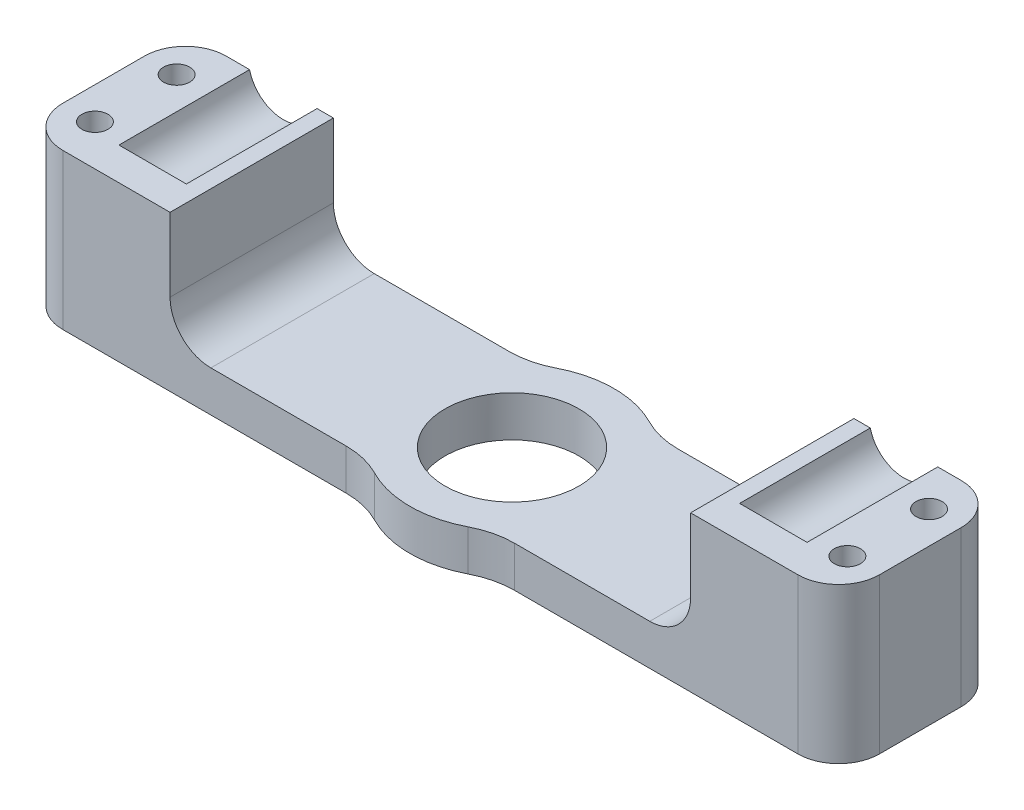
ISO-10303-21;
HEADER;
FILE_DESCRIPTION(('STEP AP214'),'2;1');
FILE_NAME('part.step','',(''),(''),'','','');
FILE_SCHEMA(('AUTOMOTIVE_DESIGN { 1 0 10303 214 1 1 1 1 }'));
ENDSEC;
DATA;
#1=APPLICATION_CONTEXT('core data for automotive mechanical design processes');
#2=APPLICATION_PROTOCOL_DEFINITION('international standard','automotive_design',2000,#1);
#3=PRODUCT_CONTEXT('',#1,'mechanical');
#4=PRODUCT('Part','Part','',(#3));
#5=PRODUCT_RELATED_PRODUCT_CATEGORY('part','',(#4));
#6=PRODUCT_DEFINITION_FORMATION('','',#4);
#7=PRODUCT_DEFINITION_CONTEXT('part definition',#1,'design');
#8=PRODUCT_DEFINITION('design','',#6,#7);
#9=PRODUCT_DEFINITION_SHAPE('','',#8);
#10=(LENGTH_UNIT() NAMED_UNIT(*) SI_UNIT(.MILLI.,.METRE.));
#11=(NAMED_UNIT(*) PLANE_ANGLE_UNIT() SI_UNIT($,.RADIAN.));
#12=(NAMED_UNIT(*) SI_UNIT($,.STERADIAN.) SOLID_ANGLE_UNIT());
#13=UNCERTAINTY_MEASURE_WITH_UNIT(LENGTH_MEASURE(1.E-05),#10,'distance_accuracy_value','');
#14=(GEOMETRIC_REPRESENTATION_CONTEXT(3) GLOBAL_UNCERTAINTY_ASSIGNED_CONTEXT((#13)) GLOBAL_UNIT_ASSIGNED_CONTEXT((#10,
#11,#12)) REPRESENTATION_CONTEXT('',''));
#15=CARTESIAN_POINT('',(0.,0.,0.));
#16=DIRECTION('',(0.,0.,1.));
#17=DIRECTION('',(1.,0.,0.));
#18=AXIS2_PLACEMENT_3D('',#15,#16,#17);
#19=CARTESIAN_POINT('',(-38.,20.,-10.));
#20=DIRECTION('',(0.,0.,1.));
#21=DIRECTION('',(1.,0.,0.));
#22=AXIS2_PLACEMENT_3D('',#19,#20,#21);
#23=CYLINDRICAL_SURFACE('',#22,4.25);
#24=CARTESIAN_POINT('',(-38.,20.,6.));
#25=DIRECTION('',(0.,0.,1.));
#26=DIRECTION('',(1.,0.,0.));
#27=AXIS2_PLACEMENT_3D('',#24,#25,#26);
#28=CIRCLE('',#27,4.25);
#29=CARTESIAN_POINT('',(-42.1306779104646,19.,6.));
#30=VERTEX_POINT('',#29);
#31=CARTESIAN_POINT('',(-33.8693220895354,19.,6.));
#32=VERTEX_POINT('',#31);
#33=EDGE_CURVE('E54',#30,#32,#28,.T.);
#34=ORIENTED_EDGE('',*,*,#33,.T.);
#35=DIRECTION('',(0.,0.,1.));
#36=VECTOR('',#35,1.);
#37=CARTESIAN_POINT('',(-33.8693220895354,19.,-10.));
#38=LINE('',#37,#36);
#39=CARTESIAN_POINT('',(-33.8693220895354,19.,-10.));
#40=VERTEX_POINT('',#39);
#41=EDGE_CURVE('E309',#32,#40,#38,.F.);
#42=ORIENTED_EDGE('',*,*,#41,.T.);
#43=CARTESIAN_POINT('',(-38.,20.,-10.));
#44=DIRECTION('',(0.,0.,1.));
#45=DIRECTION('',(1.,0.,0.));
#46=AXIS2_PLACEMENT_3D('',#43,#44,#45);
#47=CIRCLE('',#46,4.25);
#48=CARTESIAN_POINT('',(-42.1306779104646,19.,-10.));
#49=VERTEX_POINT('',#48);
#50=EDGE_CURVE('E328',#49,#40,#47,.T.);
#51=ORIENTED_EDGE('',*,*,#50,.F.);
#52=DIRECTION('',(0.,0.,1.));
#53=VECTOR('',#52,1.);
#54=CARTESIAN_POINT('',(-42.1306779104646,19.,-10.));
#55=LINE('',#54,#53);
#56=EDGE_CURVE('E59',#49,#30,#55,.T.);
#57=ORIENTED_EDGE('',*,*,#56,.T.);
#58=EDGE_LOOP('',(#34,#42,#51,#57));
#59=FACE_BOUND('',#58,.T.);
#60=ADVANCED_FACE('F39',(#59),#23,.F.);
#61=CARTESIAN_POINT('',(38.,20.,-10.));
#62=DIRECTION('',(0.,0.,1.));
#63=DIRECTION('',(1.,0.,0.));
#64=AXIS2_PLACEMENT_3D('',#61,#62,#63);
#65=CYLINDRICAL_SURFACE('',#64,4.25);
#66=CARTESIAN_POINT('',(38.,20.,6.));
#67=DIRECTION('',(0.,0.,1.));
#68=DIRECTION('',(1.,0.,0.));
#69=AXIS2_PLACEMENT_3D('',#66,#67,#68);
#70=CIRCLE('',#69,4.25);
#71=CARTESIAN_POINT('',(33.8693220895354,19.,6.));
#72=VERTEX_POINT('',#71);
#73=CARTESIAN_POINT('',(42.1306779104646,19.,6.));
#74=VERTEX_POINT('',#73);
#75=EDGE_CURVE('E224',#72,#74,#70,.T.);
#76=ORIENTED_EDGE('',*,*,#75,.T.);
#77=DIRECTION('',(0.,0.,1.));
#78=VECTOR('',#77,1.);
#79=CARTESIAN_POINT('',(42.1306779104646,19.,-10.));
#80=LINE('',#79,#78);
#81=CARTESIAN_POINT('',(42.1306779104646,19.,-10.));
#82=VERTEX_POINT('',#81);
#83=EDGE_CURVE('E210',#74,#82,#80,.F.);
#84=ORIENTED_EDGE('',*,*,#83,.T.);
#85=CARTESIAN_POINT('',(38.,20.,-10.));
#86=DIRECTION('',(0.,0.,1.));
#87=DIRECTION('',(-1.,0.,0.));
#88=AXIS2_PLACEMENT_3D('',#85,#86,#87);
#89=CIRCLE('',#88,4.25);
#90=CARTESIAN_POINT('',(33.8693220895354,19.,-10.));
#91=VERTEX_POINT('',#90);
#92=EDGE_CURVE('E332',#91,#82,#89,.T.);
#93=ORIENTED_EDGE('',*,*,#92,.F.);
#94=DIRECTION('',(0.,0.,1.));
#95=VECTOR('',#94,1.);
#96=CARTESIAN_POINT('',(33.8693220895354,19.,-10.));
#97=LINE('',#96,#95);
#98=EDGE_CURVE('E226',#91,#72,#97,.T.);
#99=ORIENTED_EDGE('',*,*,#98,.T.);
#100=EDGE_LOOP('',(#76,#84,#93,#99));
#101=FACE_BOUND('',#100,.T.);
#102=ADVANCED_FACE('F225',(#101),#65,.F.);
#103=CARTESIAN_POINT('',(-44.,40.,-10.));
#104=DIRECTION('',(0.,0.,1.));
#105=DIRECTION('',(1.,0.,0.));
#106=AXIS2_PLACEMENT_3D('',#103,#104,#105);
#107=PLANE('',#106);
#108=DIRECTION('',(1.,0.,0.));
#109=VECTOR('',#108,1.);
#110=CARTESIAN_POINT('',(-44.,19.,-10.));
#111=LINE('',#110,#109);
#112=CARTESIAN_POINT('',(45.,19.,-10.));
#113=VERTEX_POINT('',#112);
#114=EDGE_CURVE('E217',#82,#113,#111,.T.);
#115=ORIENTED_EDGE('',*,*,#114,.T.);
#116=DIRECTION('',(0.,1.,0.));
#117=VECTOR('',#116,1.);
#118=CARTESIAN_POINT('',(45.,0.,-10.));
#119=LINE('',#118,#117);
#120=CARTESIAN_POINT('',(45.,0.,-10.));
#121=VERTEX_POINT('',#120);
#122=EDGE_CURVE('E11',#113,#121,#119,.F.);
#123=ORIENTED_EDGE('',*,*,#122,.T.);
#124=DIRECTION('',(-1.,0.,0.));
#125=VECTOR('',#124,1.);
#126=CARTESIAN_POINT('',(-44.,0.,-10.));
#127=LINE('',#126,#125);
#128=CARTESIAN_POINT('',(10.3077640640441,0.,-10.));
#129=VERTEX_POINT('',#128);
#130=EDGE_CURVE('E334',#121,#129,#127,.T.);
#131=ORIENTED_EDGE('',*,*,#130,.T.);
#132=DIRECTION('',(0.,1.,0.));
#133=VECTOR('',#132,1.);
#134=CARTESIAN_POINT('',(10.3077640640441,40.,-10.));
#135=LINE('',#134,#133);
#136=CARTESIAN_POINT('',(10.3077640640441,5.,-10.));
#137=VERTEX_POINT('',#136);
#138=EDGE_CURVE('E349',#129,#137,#135,.T.);
#139=ORIENTED_EDGE('',*,*,#138,.T.);
#140=DIRECTION('',(1.,0.,0.));
#141=VECTOR('',#140,1.);
#142=CARTESIAN_POINT('',(-44.,4.99999999999999,-10.));
#143=LINE('',#142,#141);
#144=CARTESIAN_POINT('',(26.8693220895354,5.,-10.));
#145=VERTEX_POINT('',#144);
#146=EDGE_CURVE('E287',#137,#145,#143,.T.);
#147=ORIENTED_EDGE('',*,*,#146,.T.);
#148=CARTESIAN_POINT('',(26.8693220895354,10.,-10.));
#149=DIRECTION('',(0.,0.,1.));
#150=DIRECTION('',(1.,0.,0.));
#151=AXIS2_PLACEMENT_3D('',#148,#149,#150);
#152=CIRCLE('',#151,5.);
#153=CARTESIAN_POINT('',(31.8693220895354,10.,-10.));
#154=VERTEX_POINT('',#153);
#155=EDGE_CURVE('E394',#145,#154,#152,.T.);
#156=ORIENTED_EDGE('',*,*,#155,.T.);
#157=DIRECTION('',(0.,1.,0.));
#158=VECTOR('',#157,1.);
#159=CARTESIAN_POINT('',(31.8693220895354,40.,-10.));
#160=LINE('',#159,#158);
#161=CARTESIAN_POINT('',(31.8693220895354,19.,-10.));
#162=VERTEX_POINT('',#161);
#163=EDGE_CURVE('E278',#154,#162,#160,.T.);
#164=ORIENTED_EDGE('',*,*,#163,.T.);
#165=EDGE_CURVE('E312',#162,#91,#111,.T.);
#166=ORIENTED_EDGE('',*,*,#165,.T.);
#167=ORIENTED_EDGE('',*,*,#92,.T.);
#168=EDGE_LOOP('',(#115,#123,#131,#139,#147,#156,#164,#166,#167));
#169=FACE_BOUND('',#168,.T.);
#170=ADVANCED_FACE('F510',(#169),#107,.F.);
#171=CARTESIAN_POINT('',(-44.,40.,10.));
#172=DIRECTION('',(0.,0.,-1.));
#173=DIRECTION('',(-1.,0.,0.));
#174=AXIS2_PLACEMENT_3D('',#171,#172,#173);
#175=PLANE('',#174);
#176=DIRECTION('',(-1.,0.,0.));
#177=VECTOR('',#176,1.);
#178=CARTESIAN_POINT('',(-44.,19.,10.));
#179=LINE('',#178,#177);
#180=CARTESIAN_POINT('',(-31.8693220895354,19.,10.));
#181=VERTEX_POINT('',#180);
#182=CARTESIAN_POINT('',(-45.,19.,10.));
#183=VERTEX_POINT('',#182);
#184=EDGE_CURVE('E221',#181,#183,#179,.T.);
#185=ORIENTED_EDGE('',*,*,#184,.T.);
#186=DIRECTION('',(0.,-1.,0.));
#187=VECTOR('',#186,1.);
#188=CARTESIAN_POINT('',(-45.,0.,10.));
#189=LINE('',#188,#187);
#190=CARTESIAN_POINT('',(-45.,0.,10.));
#191=VERTEX_POINT('',#190);
#192=EDGE_CURVE('E415',#183,#191,#189,.T.);
#193=ORIENTED_EDGE('',*,*,#192,.T.);
#194=DIRECTION('',(1.,0.,0.));
#195=VECTOR('',#194,1.);
#196=CARTESIAN_POINT('',(-44.,0.,10.));
#197=LINE('',#196,#195);
#198=CARTESIAN_POINT('',(-10.3077640640441,0.,10.));
#199=VERTEX_POINT('',#198);
#200=EDGE_CURVE('E337',#191,#199,#197,.T.);
#201=ORIENTED_EDGE('',*,*,#200,.T.);
#202=DIRECTION('',(0.,1.,0.));
#203=VECTOR('',#202,1.);
#204=CARTESIAN_POINT('',(-10.3077640640441,40.,10.));
#205=LINE('',#204,#203);
#206=CARTESIAN_POINT('',(-10.3077640640441,4.99999999999999,10.));
#207=VERTEX_POINT('',#206);
#208=EDGE_CURVE('E346',#199,#207,#205,.T.);
#209=ORIENTED_EDGE('',*,*,#208,.T.);
#210=DIRECTION('',(-1.,0.,0.));
#211=VECTOR('',#210,1.);
#212=CARTESIAN_POINT('',(-44.,4.99999999999999,10.));
#213=LINE('',#212,#211);
#214=CARTESIAN_POINT('',(-26.8693220895354,4.99999999999999,10.));
#215=VERTEX_POINT('',#214);
#216=EDGE_CURVE('E293',#207,#215,#213,.T.);
#217=ORIENTED_EDGE('',*,*,#216,.T.);
#218=CARTESIAN_POINT('',(-26.8693220895354,9.99999999999999,10.));
#219=DIRECTION('',(0.,0.,-1.));
#220=DIRECTION('',(-1.,0.,0.));
#221=AXIS2_PLACEMENT_3D('',#218,#219,#220);
#222=CIRCLE('',#221,5.);
#223=CARTESIAN_POINT('',(-31.8693220895354,9.99999999999999,10.));
#224=VERTEX_POINT('',#223);
#225=EDGE_CURVE('E388',#215,#224,#222,.T.);
#226=ORIENTED_EDGE('',*,*,#225,.T.);
#227=DIRECTION('',(0.,1.,0.));
#228=VECTOR('',#227,1.);
#229=CARTESIAN_POINT('',(-31.8693220895354,40.,10.));
#230=LINE('',#229,#228);
#231=EDGE_CURVE('E272',#224,#181,#230,.T.);
#232=ORIENTED_EDGE('',*,*,#231,.T.);
#233=EDGE_LOOP('',(#185,#193,#201,#209,#217,#226,#232));
#234=FACE_BOUND('',#233,.T.);
#235=ADVANCED_FACE('F464',(#234),#175,.F.);
#236=CARTESIAN_POINT('',(-10.3077640640441,0.,-10.));
#237=VERTEX_POINT('',#236);
#238=CARTESIAN_POINT('',(-45.,0.,-10.));
#239=VERTEX_POINT('',#238);
#240=EDGE_CURVE('E331',#237,#239,#127,.T.);
#241=ORIENTED_EDGE('',*,*,#240,.T.);
#242=DIRECTION('',(0.,1.,0.));
#243=VECTOR('',#242,1.);
#244=CARTESIAN_POINT('',(-45.,19.,-10.));
#245=LINE('',#244,#243);
#246=CARTESIAN_POINT('',(-45.,19.,-10.));
#247=VERTEX_POINT('',#246);
#248=EDGE_CURVE('E396',#239,#247,#245,.T.);
#249=ORIENTED_EDGE('',*,*,#248,.T.);
#250=DIRECTION('',(1.,0.,0.));
#251=VECTOR('',#250,1.);
#252=CARTESIAN_POINT('',(-44.,19.,-10.));
#253=LINE('',#252,#251);
#254=EDGE_CURVE('E310',#247,#49,#253,.T.);
#255=ORIENTED_EDGE('',*,*,#254,.T.);
#256=ORIENTED_EDGE('',*,*,#50,.T.);
#257=CARTESIAN_POINT('',(-31.8693220895354,19.,-10.));
#258=VERTEX_POINT('',#257);
#259=EDGE_CURVE('E306',#40,#258,#253,.T.);
#260=ORIENTED_EDGE('',*,*,#259,.T.);
#261=DIRECTION('',(0.,-1.,0.));
#262=VECTOR('',#261,1.);
#263=CARTESIAN_POINT('',(-31.8693220895354,40.,-10.));
#264=LINE('',#263,#262);
#265=CARTESIAN_POINT('',(-31.8693220895354,9.99999999999999,-10.));
#266=VERTEX_POINT('',#265);
#267=EDGE_CURVE('E269',#258,#266,#264,.T.);
#268=ORIENTED_EDGE('',*,*,#267,.T.);
#269=CARTESIAN_POINT('',(-26.8693220895354,9.99999999999999,-10.));
#270=DIRECTION('',(0.,0.,1.));
#271=DIRECTION('',(1.,0.,0.));
#272=AXIS2_PLACEMENT_3D('',#269,#270,#271);
#273=CIRCLE('',#272,5.);
#274=CARTESIAN_POINT('',(-26.8693220895354,4.99999999999999,-10.));
#275=VERTEX_POINT('',#274);
#276=EDGE_CURVE('E390',#266,#275,#273,.T.);
#277=ORIENTED_EDGE('',*,*,#276,.T.);
#278=DIRECTION('',(1.,0.,0.));
#279=VECTOR('',#278,1.);
#280=CARTESIAN_POINT('',(-44.,4.99999999999999,-10.));
#281=LINE('',#280,#279);
#282=CARTESIAN_POINT('',(-10.3077640640441,4.99999999999999,-10.));
#283=VERTEX_POINT('',#282);
#284=EDGE_CURVE('E280',#275,#283,#281,.T.);
#285=ORIENTED_EDGE('',*,*,#284,.T.);
#286=DIRECTION('',(0.,1.,0.));
#287=VECTOR('',#286,1.);
#288=CARTESIAN_POINT('',(-10.3077640640441,40.,-10.));
#289=LINE('',#288,#287);
#290=EDGE_CURVE('E357',#283,#237,#289,.F.);
#291=ORIENTED_EDGE('',*,*,#290,.T.);
#292=EDGE_LOOP('',(#241,#249,#255,#256,#260,#268,#277,#285,#291));
#293=FACE_BOUND('',#292,.T.);
#294=ADVANCED_FACE('F483',(#293),#107,.F.);
#295=CARTESIAN_POINT('',(10.3077640640441,0.,10.));
#296=VERTEX_POINT('',#295);
#297=CARTESIAN_POINT('',(45.,0.,10.));
#298=VERTEX_POINT('',#297);
#299=EDGE_CURVE('E336',#296,#298,#197,.T.);
#300=ORIENTED_EDGE('',*,*,#299,.T.);
#301=DIRECTION('',(0.,-1.,0.));
#302=VECTOR('',#301,1.);
#303=CARTESIAN_POINT('',(45.,19.,10.));
#304=LINE('',#303,#302);
#305=CARTESIAN_POINT('',(45.,19.,10.));
#306=VERTEX_POINT('',#305);
#307=EDGE_CURVE('E424',#298,#306,#304,.F.);
#308=ORIENTED_EDGE('',*,*,#307,.T.);
#309=DIRECTION('',(-1.,0.,0.));
#310=VECTOR('',#309,1.);
#311=CARTESIAN_POINT('',(-44.,19.,10.));
#312=LINE('',#311,#310);
#313=CARTESIAN_POINT('',(31.8693220895354,19.,10.));
#314=VERTEX_POINT('',#313);
#315=EDGE_CURVE('E317',#306,#314,#312,.T.);
#316=ORIENTED_EDGE('',*,*,#315,.T.);
#317=DIRECTION('',(0.,-1.,0.));
#318=VECTOR('',#317,1.);
#319=CARTESIAN_POINT('',(31.8693220895354,40.,10.));
#320=LINE('',#319,#318);
#321=CARTESIAN_POINT('',(31.8693220895354,10.,10.));
#322=VERTEX_POINT('',#321);
#323=EDGE_CURVE('E275',#314,#322,#320,.T.);
#324=ORIENTED_EDGE('',*,*,#323,.T.);
#325=CARTESIAN_POINT('',(26.8693220895354,10.,10.));
#326=DIRECTION('',(0.,0.,-1.));
#327=DIRECTION('',(-1.,0.,0.));
#328=AXIS2_PLACEMENT_3D('',#325,#326,#327);
#329=CIRCLE('',#328,5.);
#330=CARTESIAN_POINT('',(26.8693220895354,5.,10.));
#331=VERTEX_POINT('',#330);
#332=EDGE_CURVE('E392',#322,#331,#329,.T.);
#333=ORIENTED_EDGE('',*,*,#332,.T.);
#334=DIRECTION('',(-1.,0.,0.));
#335=VECTOR('',#334,1.);
#336=CARTESIAN_POINT('',(-44.,4.99999999999999,10.));
#337=LINE('',#336,#335);
#338=CARTESIAN_POINT('',(10.3077640640441,5.,10.));
#339=VERTEX_POINT('',#338);
#340=EDGE_CURVE('E301',#331,#339,#337,.T.);
#341=ORIENTED_EDGE('',*,*,#340,.T.);
#342=DIRECTION('',(0.,1.,0.));
#343=VECTOR('',#342,1.);
#344=CARTESIAN_POINT('',(10.3077640640441,40.,10.));
#345=LINE('',#344,#343);
#346=EDGE_CURVE('E339',#339,#296,#345,.F.);
#347=ORIENTED_EDGE('',*,*,#346,.T.);
#348=EDGE_LOOP('',(#300,#308,#316,#324,#333,#341,#347));
#349=FACE_BOUND('',#348,.T.);
#350=ADVANCED_FACE('F443',(#349),#175,.F.);
#351=CARTESIAN_POINT('',(0.,0.,0.));
#352=DIRECTION('',(0.,-1.,0.));
#353=DIRECTION('',(0.,0.,-1.));
#354=AXIS2_PLACEMENT_3D('',#351,#352,#353);
#355=PLANE('',#354);
#356=CARTESIAN_POINT('',(-46.0653389552323,0.,-5.));
#357=DIRECTION('',(0.,-1.,0.));
#358=DIRECTION('',(0.,0.,1.));
#359=AXIS2_PLACEMENT_3D('',#356,#357,#358);
#360=CIRCLE('',#359,1.6);
#361=CARTESIAN_POINT('',(-46.0653389552323,0.,-3.4));
#362=VERTEX_POINT('',#361);
#363=EDGE_CURVE('E237',#362,#362,#360,.T.);
#364=ORIENTED_EDGE('',*,*,#363,.F.);
#365=EDGE_LOOP('',(#364));
#366=FACE_BOUND('',#365,.T.);
#367=CARTESIAN_POINT('',(-46.0653389552323,0.,5.));
#368=DIRECTION('',(0.,-1.,0.));
#369=DIRECTION('',(0.,0.,1.));
#370=AXIS2_PLACEMENT_3D('',#367,#368,#369);
#371=CIRCLE('',#370,1.6);
#372=CARTESIAN_POINT('',(-46.0653389552323,0.,6.6));
#373=VERTEX_POINT('',#372);
#374=EDGE_CURVE('E233',#373,#373,#371,.T.);
#375=ORIENTED_EDGE('',*,*,#374,.F.);
#376=EDGE_LOOP('',(#375));
#377=FACE_BOUND('',#376,.T.);
#378=CARTESIAN_POINT('',(46.0653389552323,0.,-5.));
#379=DIRECTION('',(0.,1.,0.));
#380=DIRECTION('',(0.,0.,1.));
#381=AXIS2_PLACEMENT_3D('',#378,#379,#380);
#382=CIRCLE('',#381,1.6);
#383=CARTESIAN_POINT('',(46.0653389552323,0.,-3.4));
#384=VERTEX_POINT('',#383);
#385=EDGE_CURVE('E252',#384,#384,#382,.T.);
#386=ORIENTED_EDGE('',*,*,#385,.T.);
#387=EDGE_LOOP('',(#386));
#388=FACE_BOUND('',#387,.T.);
#389=CARTESIAN_POINT('',(46.0653389552323,0.,5.));
#390=DIRECTION('',(0.,1.,0.));
#391=DIRECTION('',(0.,0.,1.));
#392=AXIS2_PLACEMENT_3D('',#389,#390,#391);
#393=CIRCLE('',#392,1.6);
#394=CARTESIAN_POINT('',(46.0653389552323,0.,6.6));
#395=VERTEX_POINT('',#394);
#396=EDGE_CURVE('E251',#395,#395,#393,.T.);
#397=ORIENTED_EDGE('',*,*,#396,.T.);
#398=EDGE_LOOP('',(#397));
#399=FACE_BOUND('',#398,.T.);
#400=CARTESIAN_POINT('',(0.,0.,0.));
#401=DIRECTION('',(0.,1.,0.));
#402=DIRECTION('',(0.,0.,1.));
#403=AXIS2_PLACEMENT_3D('',#400,#401,#402);
#404=CIRCLE('',#403,8.2);
#405=CARTESIAN_POINT('',(0.,0.,8.2));
#406=VERTEX_POINT('',#405);
#407=EDGE_CURVE('E321',#406,#406,#404,.T.);
#408=ORIENTED_EDGE('',*,*,#407,.T.);
#409=EDGE_LOOP('',(#408));
#410=FACE_BOUND('',#409,.T.);
#411=DIRECTION('',(0.,0.,-1.));
#412=VECTOR('',#411,1.);
#413=CARTESIAN_POINT('',(-50.,0.,10.));
#414=LINE('',#413,#412);
#415=CARTESIAN_POINT('',(-50.,0.,5.));
#416=VERTEX_POINT('',#415);
#417=CARTESIAN_POINT('',(-50.,0.,-5.));
#418=VERTEX_POINT('',#417);
#419=EDGE_CURVE('E240',#416,#418,#414,.T.);
#420=ORIENTED_EDGE('',*,*,#419,.T.);
#421=CARTESIAN_POINT('',(-45.,0.,-5.));
#422=DIRECTION('',(0.,-1.,0.));
#423=DIRECTION('',(0.,0.,-1.));
#424=AXIS2_PLACEMENT_3D('',#421,#422,#423);
#425=CIRCLE('',#424,5.);
#426=EDGE_CURVE('E413',#418,#239,#425,.T.);
#427=ORIENTED_EDGE('',*,*,#426,.T.);
#428=ORIENTED_EDGE('',*,*,#240,.F.);
#429=CARTESIAN_POINT('',(-10.3077640640441,0.,-20.));
#430=DIRECTION('',(0.,-1.,0.));
#431=DIRECTION('',(0.,0.,-1.));
#432=AXIS2_PLACEMENT_3D('',#429,#430,#431);
#433=CIRCLE('',#432,10.);
#434=CARTESIAN_POINT('',(-5.72653559113563,0.,-11.1111111111111));
#435=VERTEX_POINT('',#434);
#436=EDGE_CURVE('E367',#237,#435,#433,.F.);
#437=ORIENTED_EDGE('',*,*,#436,.T.);
#438=CARTESIAN_POINT('',(0.,0.,0.));
#439=DIRECTION('',(0.,-1.,0.));
#440=DIRECTION('',(0.,0.,-1.));
#441=AXIS2_PLACEMENT_3D('',#438,#439,#440);
#442=CIRCLE('',#441,12.5);
#443=CARTESIAN_POINT('',(5.72653559113563,0.,-11.1111111111111));
#444=VERTEX_POINT('',#443);
#445=EDGE_CURVE('E324',#444,#435,#442,.F.);
#446=ORIENTED_EDGE('',*,*,#445,.F.);
#447=CARTESIAN_POINT('',(10.3077640640441,0.,-20.));
#448=DIRECTION('',(0.,-1.,0.));
#449=DIRECTION('',(0.,0.,-1.));
#450=AXIS2_PLACEMENT_3D('',#447,#448,#449);
#451=CIRCLE('',#450,10.);
#452=EDGE_CURVE('E364',#444,#129,#451,.F.);
#453=ORIENTED_EDGE('',*,*,#452,.T.);
#454=ORIENTED_EDGE('',*,*,#130,.F.);
#455=CARTESIAN_POINT('',(45.,0.,-5.));
#456=DIRECTION('',(0.,-1.,0.));
#457=DIRECTION('',(0.,0.,-1.));
#458=AXIS2_PLACEMENT_3D('',#455,#456,#457);
#459=CIRCLE('',#458,5.);
#460=CARTESIAN_POINT('',(50.,0.,-5.));
#461=VERTEX_POINT('',#460);
#462=EDGE_CURVE('E407',#121,#461,#459,.T.);
#463=ORIENTED_EDGE('',*,*,#462,.T.);
#464=DIRECTION('',(0.,0.,-1.));
#465=VECTOR('',#464,1.);
#466=CARTESIAN_POINT('',(50.,0.,10.));
#467=LINE('',#466,#465);
#468=CARTESIAN_POINT('',(50.,0.,5.));
#469=VERTEX_POINT('',#468);
#470=EDGE_CURVE('E255',#469,#461,#467,.T.);
#471=ORIENTED_EDGE('',*,*,#470,.F.);
#472=CARTESIAN_POINT('',(45.,0.,5.));
#473=DIRECTION('',(0.,-1.,0.));
#474=DIRECTION('',(0.,0.,-1.));
#475=AXIS2_PLACEMENT_3D('',#472,#473,#474);
#476=CIRCLE('',#475,5.);
#477=EDGE_CURVE('E409',#469,#298,#476,.T.);
#478=ORIENTED_EDGE('',*,*,#477,.T.);
#479=ORIENTED_EDGE('',*,*,#299,.F.);
#480=CARTESIAN_POINT('',(10.3077640640441,0.,20.));
#481=DIRECTION('',(0.,-1.,0.));
#482=DIRECTION('',(0.,0.,-1.));
#483=AXIS2_PLACEMENT_3D('',#480,#481,#482);
#484=CIRCLE('',#483,10.);
#485=CARTESIAN_POINT('',(5.72653559113563,0.,11.1111111111111));
#486=VERTEX_POINT('',#485);
#487=EDGE_CURVE('E359',#296,#486,#484,.F.);
#488=ORIENTED_EDGE('',*,*,#487,.T.);
#489=CARTESIAN_POINT('',(-5.72653559113563,0.,11.1111111111111));
#490=VERTEX_POINT('',#489);
#491=EDGE_CURVE('E327',#490,#486,#442,.F.);
#492=ORIENTED_EDGE('',*,*,#491,.F.);
#493=CARTESIAN_POINT('',(-10.3077640640441,0.,20.));
#494=DIRECTION('',(0.,-1.,0.));
#495=DIRECTION('',(0.,0.,-1.));
#496=AXIS2_PLACEMENT_3D('',#493,#494,#495);
#497=CIRCLE('',#496,10.);
#498=EDGE_CURVE('E361',#490,#199,#497,.F.);
#499=ORIENTED_EDGE('',*,*,#498,.T.);
#500=ORIENTED_EDGE('',*,*,#200,.F.);
#501=CARTESIAN_POINT('',(-45.,0.,5.));
#502=DIRECTION('',(0.,-1.,0.));
#503=DIRECTION('',(0.,0.,-1.));
#504=AXIS2_PLACEMENT_3D('',#501,#502,#503);
#505=CIRCLE('',#504,5.);
#506=EDGE_CURVE('E411',#191,#416,#505,.T.);
#507=ORIENTED_EDGE('',*,*,#506,.T.);
#508=EDGE_LOOP('',(#420,#427,#428,#437,#446,#453,#454,#463,#471,#478,#479,#488,#492,#499,#500,#507));
#509=FACE_BOUND('',#508,.T.);
#510=ADVANCED_FACE('F441',(#366,#377,#388,#399,#410,#509),#355,.T.);
#511=CARTESIAN_POINT('',(0.,-35.3553390593274,0.));
#512=DIRECTION('',(0.,1.,0.));
#513=DIRECTION('',(0.,0.,1.));
#514=AXIS2_PLACEMENT_3D('',#511,#512,#513);
#515=CYLINDRICAL_SURFACE('',#514,12.5);
#516=CARTESIAN_POINT('',(0.,5.,0.));
#517=DIRECTION('',(0.,-1.,0.));
#518=DIRECTION('',(1.,0.,0.));
#519=AXIS2_PLACEMENT_3D('',#516,#517,#518);
#520=CIRCLE('',#519,12.5);
#521=CARTESIAN_POINT('',(-5.72653559113563,4.99999999999999,11.1111111111111));
#522=VERTEX_POINT('',#521);
#523=CARTESIAN_POINT('',(5.72653559113563,5.,11.1111111111111));
#524=VERTEX_POINT('',#523);
#525=EDGE_CURVE('E294',#522,#524,#520,.F.);
#526=ORIENTED_EDGE('',*,*,#525,.F.);
#527=DIRECTION('',(0.,1.,0.));
#528=VECTOR('',#527,1.);
#529=CARTESIAN_POINT('',(-5.72653559113563,-35.3553390593274,11.1111111111111));
#530=LINE('',#529,#528);
#531=EDGE_CURVE('E341',#522,#490,#530,.F.);
#532=ORIENTED_EDGE('',*,*,#531,.T.);
#533=ORIENTED_EDGE('',*,*,#491,.T.);
#534=DIRECTION('',(0.,1.,0.));
#535=VECTOR('',#534,1.);
#536=CARTESIAN_POINT('',(5.72653559113563,-35.3553390593274,11.1111111111111));
#537=LINE('',#536,#535);
#538=EDGE_CURVE('E343',#486,#524,#537,.T.);
#539=ORIENTED_EDGE('',*,*,#538,.T.);
#540=EDGE_LOOP('',(#526,#532,#533,#539));
#541=FACE_BOUND('',#540,.T.);
#542=ADVANCED_FACE('F455',(#541),#515,.T.);
#543=DIRECTION('',(0.,1.,0.));
#544=VECTOR('',#543,1.);
#545=CARTESIAN_POINT('',(-5.72653559113563,-35.3553390593274,-11.1111111111111));
#546=LINE('',#545,#544);
#547=CARTESIAN_POINT('',(-5.72653559113563,4.99999999999999,-11.1111111111111));
#548=VERTEX_POINT('',#547);
#549=EDGE_CURVE('E352',#435,#548,#546,.T.);
#550=ORIENTED_EDGE('',*,*,#549,.T.);
#551=CARTESIAN_POINT('',(0.,5.,0.));
#552=DIRECTION('',(0.,-1.,0.));
#553=DIRECTION('',(1.,0.,0.));
#554=AXIS2_PLACEMENT_3D('',#551,#552,#553);
#555=CIRCLE('',#554,12.5);
#556=CARTESIAN_POINT('',(5.72653559113563,5.,-11.1111111111111));
#557=VERTEX_POINT('',#556);
#558=EDGE_CURVE('E281',#557,#548,#555,.F.);
#559=ORIENTED_EDGE('',*,*,#558,.F.);
#560=DIRECTION('',(0.,1.,0.));
#561=VECTOR('',#560,1.);
#562=CARTESIAN_POINT('',(5.72653559113563,-35.3553390593274,-11.1111111111111));
#563=LINE('',#562,#561);
#564=EDGE_CURVE('E355',#557,#444,#563,.F.);
#565=ORIENTED_EDGE('',*,*,#564,.T.);
#566=ORIENTED_EDGE('',*,*,#445,.T.);
#567=EDGE_LOOP('',(#550,#559,#565,#566));
#568=FACE_BOUND('',#567,.T.);
#569=ADVANCED_FACE('F492',(#568),#515,.T.);
#570=CARTESIAN_POINT('',(0.,0.,0.));
#571=DIRECTION('',(0.,1.,0.));
#572=DIRECTION('',(0.,0.,1.));
#573=AXIS2_PLACEMENT_3D('',#570,#571,#572);
#574=CYLINDRICAL_SURFACE('',#573,8.2);
#575=CARTESIAN_POINT('',(0.,5.,0.));
#576=DIRECTION('',(0.,-1.,0.));
#577=DIRECTION('',(1.,0.,0.));
#578=AXIS2_PLACEMENT_3D('',#575,#576,#577);
#579=CIRCLE('',#578,8.2);
#580=CARTESIAN_POINT('',(8.2,5.,0.));
#581=VERTEX_POINT('',#580);
#582=EDGE_CURVE('E303',#581,#581,#579,.F.);
#583=ORIENTED_EDGE('',*,*,#582,.T.);
#584=EDGE_LOOP('',(#583));
#585=FACE_BOUND('',#584,.T.);
#586=ORIENTED_EDGE('',*,*,#407,.F.);
#587=EDGE_LOOP('',(#586));
#588=FACE_BOUND('',#587,.T.);
#589=ADVANCED_FACE('F550',(#585,#588),#574,.F.);
#590=CARTESIAN_POINT('',(10.3077640640441,-35.3553390593274,20.));
#591=DIRECTION('',(0.,1.,0.));
#592=DIRECTION('',(0.,0.,1.));
#593=AXIS2_PLACEMENT_3D('',#590,#591,#592);
#594=CYLINDRICAL_SURFACE('',#593,10.);
#595=ORIENTED_EDGE('',*,*,#346,.F.);
#596=CARTESIAN_POINT('',(10.3077640640441,5.,20.));
#597=DIRECTION('',(0.,-1.,0.));
#598=DIRECTION('',(1.,0.,0.));
#599=AXIS2_PLACEMENT_3D('',#596,#597,#598);
#600=CIRCLE('',#599,10.);
#601=EDGE_CURVE('E296',#339,#524,#600,.F.);
#602=ORIENTED_EDGE('',*,*,#601,.T.);
#603=ORIENTED_EDGE('',*,*,#538,.F.);
#604=ORIENTED_EDGE('',*,*,#487,.F.);
#605=EDGE_LOOP('',(#595,#602,#603,#604));
#606=FACE_BOUND('',#605,.T.);
#607=ADVANCED_FACE('F450',(#606),#594,.F.);
#608=CARTESIAN_POINT('',(-10.3077640640441,-35.3553390593274,20.));
#609=DIRECTION('',(0.,1.,0.));
#610=DIRECTION('',(0.,0.,1.));
#611=AXIS2_PLACEMENT_3D('',#608,#609,#610);
#612=CYLINDRICAL_SURFACE('',#611,10.);
#613=ORIENTED_EDGE('',*,*,#531,.F.);
#614=CARTESIAN_POINT('',(-10.3077640640441,4.99999999999999,20.));
#615=DIRECTION('',(0.,-1.,0.));
#616=DIRECTION('',(1.,0.,0.));
#617=AXIS2_PLACEMENT_3D('',#614,#615,#616);
#618=CIRCLE('',#617,10.);
#619=EDGE_CURVE('E290',#522,#207,#618,.F.);
#620=ORIENTED_EDGE('',*,*,#619,.T.);
#621=ORIENTED_EDGE('',*,*,#208,.F.);
#622=ORIENTED_EDGE('',*,*,#498,.F.);
#623=EDGE_LOOP('',(#613,#620,#621,#622));
#624=FACE_BOUND('',#623,.T.);
#625=ADVANCED_FACE('F459',(#624),#612,.F.);
#626=CARTESIAN_POINT('',(10.3077640640441,-35.3553390593274,-20.));
#627=DIRECTION('',(0.,1.,0.));
#628=DIRECTION('',(0.,0.,1.));
#629=AXIS2_PLACEMENT_3D('',#626,#627,#628);
#630=CYLINDRICAL_SURFACE('',#629,10.);
#631=ORIENTED_EDGE('',*,*,#564,.F.);
#632=CARTESIAN_POINT('',(10.3077640640441,5.,-20.));
#633=DIRECTION('',(0.,-1.,0.));
#634=DIRECTION('',(1.,0.,0.));
#635=AXIS2_PLACEMENT_3D('',#632,#633,#634);
#636=CIRCLE('',#635,10.);
#637=EDGE_CURVE('E283',#557,#137,#636,.F.);
#638=ORIENTED_EDGE('',*,*,#637,.T.);
#639=ORIENTED_EDGE('',*,*,#138,.F.);
#640=ORIENTED_EDGE('',*,*,#452,.F.);
#641=EDGE_LOOP('',(#631,#638,#639,#640));
#642=FACE_BOUND('',#641,.T.);
#643=ADVANCED_FACE('F503',(#642),#630,.F.);
#644=CARTESIAN_POINT('',(-10.3077640640441,-35.3553390593274,-20.));
#645=DIRECTION('',(0.,1.,0.));
#646=DIRECTION('',(0.,0.,1.));
#647=AXIS2_PLACEMENT_3D('',#644,#645,#646);
#648=CYLINDRICAL_SURFACE('',#647,10.);
#649=ORIENTED_EDGE('',*,*,#290,.F.);
#650=CARTESIAN_POINT('',(-10.3077640640441,4.99999999999999,-20.));
#651=DIRECTION('',(0.,-1.,0.));
#652=DIRECTION('',(1.,0.,0.));
#653=AXIS2_PLACEMENT_3D('',#650,#651,#652);
#654=CIRCLE('',#653,10.);
#655=EDGE_CURVE('E375',#283,#548,#654,.F.);
#656=ORIENTED_EDGE('',*,*,#655,.T.);
#657=ORIENTED_EDGE('',*,*,#549,.F.);
#658=ORIENTED_EDGE('',*,*,#436,.F.);
#659=EDGE_LOOP('',(#649,#656,#657,#658));
#660=FACE_BOUND('',#659,.T.);
#661=ADVANCED_FACE('F495',(#660),#648,.F.);
#662=CARTESIAN_POINT('',(44.,19.,-13.5));
#663=DIRECTION('',(0.,-1.,0.));
#664=DIRECTION('',(0.,0.,-1.));
#665=AXIS2_PLACEMENT_3D('',#662,#663,#664);
#666=PLANE('',#665);
#667=CARTESIAN_POINT('',(-46.0653389552323,19.,-5.));
#668=DIRECTION('',(0.,-1.,0.));
#669=DIRECTION('',(0.,0.,1.));
#670=AXIS2_PLACEMENT_3D('',#667,#668,#669);
#671=CIRCLE('',#670,1.6);
#672=CARTESIAN_POINT('',(-46.0653389552323,19.,-3.4));
#673=VERTEX_POINT('',#672);
#674=EDGE_CURVE('E241',#673,#673,#671,.T.);
#675=ORIENTED_EDGE('',*,*,#674,.T.);
#676=EDGE_LOOP('',(#675));
#677=FACE_BOUND('',#676,.T.);
#678=CARTESIAN_POINT('',(-46.0653389552323,19.,5.));
#679=DIRECTION('',(0.,-1.,0.));
#680=DIRECTION('',(0.,0.,1.));
#681=AXIS2_PLACEMENT_3D('',#678,#679,#680);
#682=CIRCLE('',#681,1.6);
#683=CARTESIAN_POINT('',(-46.0653389552323,19.,6.6));
#684=VERTEX_POINT('',#683);
#685=EDGE_CURVE('E230',#684,#684,#682,.T.);
#686=ORIENTED_EDGE('',*,*,#685,.T.);
#687=EDGE_LOOP('',(#686));
#688=FACE_BOUND('',#687,.T.);
#689=ORIENTED_EDGE('',*,*,#254,.F.);
#690=CARTESIAN_POINT('',(-45.,19.,-5.));
#691=DIRECTION('',(0.,-1.,0.));
#692=DIRECTION('',(0.,0.,-1.));
#693=AXIS2_PLACEMENT_3D('',#690,#691,#692);
#694=CIRCLE('',#693,5.);
#695=CARTESIAN_POINT('',(-50.,19.,-5.));
#696=VERTEX_POINT('',#695);
#697=EDGE_CURVE('E401',#247,#696,#694,.F.);
#698=ORIENTED_EDGE('',*,*,#697,.T.);
#699=DIRECTION('',(0.,0.,1.));
#700=VECTOR('',#699,1.);
#701=CARTESIAN_POINT('',(-50.,19.,-10.));
#702=LINE('',#701,#700);
#703=CARTESIAN_POINT('',(-50.,19.,5.));
#704=VERTEX_POINT('',#703);
#705=EDGE_CURVE('E248',#696,#704,#702,.T.);
#706=ORIENTED_EDGE('',*,*,#705,.T.);
#707=CARTESIAN_POINT('',(-45.,19.,5.));
#708=DIRECTION('',(0.,-1.,0.));
#709=DIRECTION('',(0.,0.,-1.));
#710=AXIS2_PLACEMENT_3D('',#707,#708,#709);
#711=CIRCLE('',#710,5.);
#712=EDGE_CURVE('E399',#704,#183,#711,.F.);
#713=ORIENTED_EDGE('',*,*,#712,.T.);
#714=ORIENTED_EDGE('',*,*,#184,.F.);
#715=DIRECTION('',(0.,0.,-1.));
#716=VECTOR('',#715,1.);
#717=CARTESIAN_POINT('',(-31.8693220895354,19.,-13.5));
#718=LINE('',#717,#716);
#719=EDGE_CURVE('E369',#181,#258,#718,.T.);
#720=ORIENTED_EDGE('',*,*,#719,.T.);
#721=ORIENTED_EDGE('',*,*,#259,.F.);
#722=ORIENTED_EDGE('',*,*,#41,.F.);
#723=DIRECTION('',(-1.,0.,0.));
#724=VECTOR('',#723,1.);
#725=CARTESIAN_POINT('',(-42.1306779104646,19.,6.));
#726=LINE('',#725,#724);
#727=EDGE_CURVE('E937',#32,#30,#726,.T.);
#728=ORIENTED_EDGE('',*,*,#727,.T.);
#729=ORIENTED_EDGE('',*,*,#56,.F.);
#730=EDGE_LOOP('',(#689,#698,#706,#713,#714,#720,#721,#722,#728,#729));
#731=FACE_BOUND('',#730,.T.);
#732=ADVANCED_FACE('F476',(#677,#688,#731),#666,.F.);
#733=CARTESIAN_POINT('',(46.0653389552323,19.,-5.));
#734=DIRECTION('',(0.,1.,0.));
#735=DIRECTION('',(0.,0.,1.));
#736=AXIS2_PLACEMENT_3D('',#733,#734,#735);
#737=CIRCLE('',#736,1.6);
#738=CARTESIAN_POINT('',(46.0653389552323,19.,-3.4));
#739=VERTEX_POINT('',#738);
#740=EDGE_CURVE('E256',#739,#739,#737,.T.);
#741=ORIENTED_EDGE('',*,*,#740,.F.);
#742=EDGE_LOOP('',(#741));
#743=FACE_BOUND('',#742,.T.);
#744=CARTESIAN_POINT('',(46.0653389552323,19.,5.));
#745=DIRECTION('',(0.,1.,0.));
#746=DIRECTION('',(0.,0.,1.));
#747=AXIS2_PLACEMENT_3D('',#744,#745,#746);
#748=CIRCLE('',#747,1.6);
#749=CARTESIAN_POINT('',(46.0653389552323,19.,6.6));
#750=VERTEX_POINT('',#749);
#751=EDGE_CURVE('E259',#750,#750,#748,.T.);
#752=ORIENTED_EDGE('',*,*,#751,.F.);
#753=EDGE_LOOP('',(#752));
#754=FACE_BOUND('',#753,.T.);
#755=ORIENTED_EDGE('',*,*,#315,.F.);
#756=CARTESIAN_POINT('',(45.,19.,5.));
#757=DIRECTION('',(0.,-1.,0.));
#758=DIRECTION('',(0.,0.,-1.));
#759=AXIS2_PLACEMENT_3D('',#756,#757,#758);
#760=CIRCLE('',#759,5.);
#761=CARTESIAN_POINT('',(50.,19.,5.));
#762=VERTEX_POINT('',#761);
#763=EDGE_CURVE('E47',#306,#762,#760,.F.);
#764=ORIENTED_EDGE('',*,*,#763,.T.);
#765=DIRECTION('',(0.,0.,1.));
#766=VECTOR('',#765,1.);
#767=CARTESIAN_POINT('',(50.,19.,-10.));
#768=LINE('',#767,#766);
#769=CARTESIAN_POINT('',(50.,19.,-5.));
#770=VERTEX_POINT('',#769);
#771=EDGE_CURVE('E266',#770,#762,#768,.T.);
#772=ORIENTED_EDGE('',*,*,#771,.F.);
#773=CARTESIAN_POINT('',(45.,19.,-5.));
#774=DIRECTION('',(0.,-1.,0.));
#775=DIRECTION('',(0.,0.,-1.));
#776=AXIS2_PLACEMENT_3D('',#773,#774,#775);
#777=CIRCLE('',#776,5.);
#778=EDGE_CURVE('E427',#770,#113,#777,.F.);
#779=ORIENTED_EDGE('',*,*,#778,.T.);
#780=ORIENTED_EDGE('',*,*,#114,.F.);
#781=ORIENTED_EDGE('',*,*,#83,.F.);
#782=DIRECTION('',(-1.,0.,0.));
#783=VECTOR('',#782,1.);
#784=CARTESIAN_POINT('',(33.8693220895354,19.,6.));
#785=LINE('',#784,#783);
#786=EDGE_CURVE('E215',#74,#72,#785,.T.);
#787=ORIENTED_EDGE('',*,*,#786,.T.);
#788=ORIENTED_EDGE('',*,*,#98,.F.);
#789=ORIENTED_EDGE('',*,*,#165,.F.);
#790=DIRECTION('',(0.,0.,1.));
#791=VECTOR('',#790,1.);
#792=CARTESIAN_POINT('',(31.8693220895354,19.,-13.5));
#793=LINE('',#792,#791);
#794=EDGE_CURVE('E372',#162,#314,#793,.T.);
#795=ORIENTED_EDGE('',*,*,#794,.T.);
#796=EDGE_LOOP('',(#755,#764,#772,#779,#780,#781,#787,#788,#789,#795));
#797=FACE_BOUND('',#796,.T.);
#798=ADVANCED_FACE('F212',(#743,#754,#797),#666,.F.);
#799=CARTESIAN_POINT('',(31.8693220895354,5.,-12.5));
#800=DIRECTION('',(0.,-1.,0.));
#801=DIRECTION('',(1.,0.,0.));
#802=AXIS2_PLACEMENT_3D('',#799,#800,#801);
#803=PLANE('',#802);
#804=ORIENTED_EDGE('',*,*,#284,.F.);
#805=DIRECTION('',(0.,0.,1.));
#806=VECTOR('',#805,1.);
#807=CARTESIAN_POINT('',(-26.8693220895354,4.99999999999999,10.));
#808=LINE('',#807,#806);
#809=EDGE_CURVE('E380',#275,#215,#808,.T.);
#810=ORIENTED_EDGE('',*,*,#809,.T.);
#811=ORIENTED_EDGE('',*,*,#216,.F.);
#812=ORIENTED_EDGE('',*,*,#619,.F.);
#813=ORIENTED_EDGE('',*,*,#525,.T.);
#814=ORIENTED_EDGE('',*,*,#601,.F.);
#815=ORIENTED_EDGE('',*,*,#340,.F.);
#816=DIRECTION('',(0.,0.,1.));
#817=VECTOR('',#816,1.);
#818=CARTESIAN_POINT('',(26.8693220895354,5.,-10.));
#819=LINE('',#818,#817);
#820=EDGE_CURVE('E378',#331,#145,#819,.F.);
#821=ORIENTED_EDGE('',*,*,#820,.T.);
#822=ORIENTED_EDGE('',*,*,#146,.F.);
#823=ORIENTED_EDGE('',*,*,#637,.F.);
#824=ORIENTED_EDGE('',*,*,#558,.T.);
#825=ORIENTED_EDGE('',*,*,#655,.F.);
#826=EDGE_LOOP('',(#804,#810,#811,#812,#813,#814,#815,#821,#822,#823,#824,#825));
#827=FACE_BOUND('',#826,.T.);
#828=ORIENTED_EDGE('',*,*,#582,.F.);
#829=EDGE_LOOP('',(#828));
#830=FACE_BOUND('',#829,.T.);
#831=ADVANCED_FACE('F499',(#827,#830),#803,.F.);
#832=CARTESIAN_POINT('',(31.8693220895354,21.,-12.5));
#833=DIRECTION('',(1.,0.,0.));
#834=DIRECTION('',(0.,1.,0.));
#835=AXIS2_PLACEMENT_3D('',#832,#833,#834);
#836=PLANE('',#835);
#837=ORIENTED_EDGE('',*,*,#163,.F.);
#838=DIRECTION('',(0.,0.,1.));
#839=VECTOR('',#838,1.);
#840=CARTESIAN_POINT('',(31.8693220895354,10.,10.));
#841=LINE('',#840,#839);
#842=EDGE_CURVE('E385',#154,#322,#841,.T.);
#843=ORIENTED_EDGE('',*,*,#842,.T.);
#844=ORIENTED_EDGE('',*,*,#323,.F.);
#845=ORIENTED_EDGE('',*,*,#794,.F.);
#846=EDGE_LOOP('',(#837,#843,#844,#845));
#847=FACE_BOUND('',#846,.T.);
#848=ADVANCED_FACE('F515',(#847),#836,.F.);
#849=CARTESIAN_POINT('',(-31.8693220895354,21.,-12.5));
#850=DIRECTION('',(-1.,0.,0.));
#851=DIRECTION('',(0.,-1.,0.));
#852=AXIS2_PLACEMENT_3D('',#849,#850,#851);
#853=PLANE('',#852);
#854=ORIENTED_EDGE('',*,*,#231,.F.);
#855=DIRECTION('',(0.,0.,1.));
#856=VECTOR('',#855,1.);
#857=CARTESIAN_POINT('',(-31.8693220895354,9.99999999999999,-10.));
#858=LINE('',#857,#856);
#859=EDGE_CURVE('E383',#224,#266,#858,.F.);
#860=ORIENTED_EDGE('',*,*,#859,.T.);
#861=ORIENTED_EDGE('',*,*,#267,.F.);
#862=ORIENTED_EDGE('',*,*,#719,.F.);
#863=EDGE_LOOP('',(#854,#860,#861,#862));
#864=FACE_BOUND('',#863,.T.);
#865=ADVANCED_FACE('F526',(#864),#853,.F.);
#866=CARTESIAN_POINT('',(-26.8693220895354,9.99999999999999,-12.5));
#867=DIRECTION('',(0.,0.,-1.));
#868=DIRECTION('',(-1.,0.,0.));
#869=AXIS2_PLACEMENT_3D('',#866,#867,#868);
#870=CYLINDRICAL_SURFACE('',#869,5.);
#871=ORIENTED_EDGE('',*,*,#276,.F.);
#872=ORIENTED_EDGE('',*,*,#859,.F.);
#873=ORIENTED_EDGE('',*,*,#225,.F.);
#874=ORIENTED_EDGE('',*,*,#809,.F.);
#875=EDGE_LOOP('',(#871,#872,#873,#874));
#876=FACE_BOUND('',#875,.T.);
#877=ADVANCED_FACE('F528',(#876),#870,.F.);
#878=CARTESIAN_POINT('',(26.8693220895354,10.,-12.5));
#879=DIRECTION('',(0.,0.,-1.));
#880=DIRECTION('',(-1.,0.,0.));
#881=AXIS2_PLACEMENT_3D('',#878,#879,#880);
#882=CYLINDRICAL_SURFACE('',#881,5.);
#883=ORIENTED_EDGE('',*,*,#155,.F.);
#884=ORIENTED_EDGE('',*,*,#820,.F.);
#885=ORIENTED_EDGE('',*,*,#332,.F.);
#886=ORIENTED_EDGE('',*,*,#842,.F.);
#887=EDGE_LOOP('',(#883,#884,#885,#886));
#888=FACE_BOUND('',#887,.T.);
#889=ADVANCED_FACE('F519',(#888),#882,.F.);
#890=CARTESIAN_POINT('',(50.,0.,0.));
#891=DIRECTION('',(1.,0.,0.));
#892=DIRECTION('',(0.,0.,-1.));
#893=AXIS2_PLACEMENT_3D('',#890,#891,#892);
#894=PLANE('',#893);
#895=ORIENTED_EDGE('',*,*,#771,.T.);
#896=DIRECTION('',(0.,-1.,0.));
#897=VECTOR('',#896,1.);
#898=CARTESIAN_POINT('',(50.,0.,5.));
#899=LINE('',#898,#897);
#900=EDGE_CURVE('E421',#762,#469,#899,.T.);
#901=ORIENTED_EDGE('',*,*,#900,.T.);
#902=ORIENTED_EDGE('',*,*,#470,.T.);
#903=DIRECTION('',(0.,1.,0.));
#904=VECTOR('',#903,1.);
#905=CARTESIAN_POINT('',(50.,19.,-5.));
#906=LINE('',#905,#904);
#907=EDGE_CURVE('E418',#461,#770,#906,.T.);
#908=ORIENTED_EDGE('',*,*,#907,.T.);
#909=EDGE_LOOP('',(#895,#901,#902,#908));
#910=FACE_BOUND('',#909,.T.);
#911=ADVANCED_FACE('F434',(#910),#894,.T.);
#912=CARTESIAN_POINT('',(46.0653389552323,0.,5.));
#913=DIRECTION('',(0.,1.,0.));
#914=DIRECTION('',(0.,0.,1.));
#915=AXIS2_PLACEMENT_3D('',#912,#913,#914);
#916=CYLINDRICAL_SURFACE('',#915,1.6);
#917=ORIENTED_EDGE('',*,*,#396,.F.);
#918=EDGE_LOOP('',(#917));
#919=FACE_BOUND('',#918,.T.);
#920=ORIENTED_EDGE('',*,*,#751,.T.);
#921=EDGE_LOOP('',(#920));
#922=FACE_BOUND('',#921,.T.);
#923=ADVANCED_FACE('F592',(#919,#922),#916,.F.);
#924=CARTESIAN_POINT('',(46.0653389552323,0.,-5.));
#925=DIRECTION('',(0.,1.,0.));
#926=DIRECTION('',(0.,0.,1.));
#927=AXIS2_PLACEMENT_3D('',#924,#925,#926);
#928=CYLINDRICAL_SURFACE('',#927,1.6);
#929=ORIENTED_EDGE('',*,*,#385,.F.);
#930=EDGE_LOOP('',(#929));
#931=FACE_BOUND('',#930,.T.);
#932=ORIENTED_EDGE('',*,*,#740,.T.);
#933=EDGE_LOOP('',(#932));
#934=FACE_BOUND('',#933,.T.);
#935=ADVANCED_FACE('F589',(#931,#934),#928,.F.);
#936=CARTESIAN_POINT('',(-50.,0.,0.));
#937=DIRECTION('',(-1.,0.,0.));
#938=DIRECTION('',(0.,0.,-1.));
#939=AXIS2_PLACEMENT_3D('',#936,#937,#938);
#940=PLANE('',#939);
#941=ORIENTED_EDGE('',*,*,#705,.F.);
#942=DIRECTION('',(0.,1.,0.));
#943=VECTOR('',#942,1.);
#944=CARTESIAN_POINT('',(-50.,0.,-5.));
#945=LINE('',#944,#943);
#946=EDGE_CURVE('E405',#696,#418,#945,.F.);
#947=ORIENTED_EDGE('',*,*,#946,.T.);
#948=ORIENTED_EDGE('',*,*,#419,.F.);
#949=DIRECTION('',(0.,-1.,0.));
#950=VECTOR('',#949,1.);
#951=CARTESIAN_POINT('',(-50.,19.,5.));
#952=LINE('',#951,#950);
#953=EDGE_CURVE('E403',#416,#704,#952,.F.);
#954=ORIENTED_EDGE('',*,*,#953,.T.);
#955=EDGE_LOOP('',(#941,#947,#948,#954));
#956=FACE_BOUND('',#955,.T.);
#957=ADVANCED_FACE('F472',(#956),#940,.T.);
#958=CARTESIAN_POINT('',(-46.0653389552323,0.,5.));
#959=DIRECTION('',(0.,1.,0.));
#960=DIRECTION('',(0.,0.,1.));
#961=AXIS2_PLACEMENT_3D('',#958,#959,#960);
#962=CYLINDRICAL_SURFACE('',#961,1.6);
#963=ORIENTED_EDGE('',*,*,#374,.T.);
#964=EDGE_LOOP('',(#963));
#965=FACE_BOUND('',#964,.T.);
#966=ORIENTED_EDGE('',*,*,#685,.F.);
#967=EDGE_LOOP('',(#966));
#968=FACE_BOUND('',#967,.T.);
#969=ADVANCED_FACE('F582',(#965,#968),#962,.F.);
#970=CARTESIAN_POINT('',(-46.0653389552323,0.,-5.));
#971=DIRECTION('',(0.,1.,0.));
#972=DIRECTION('',(0.,0.,1.));
#973=AXIS2_PLACEMENT_3D('',#970,#971,#972);
#974=CYLINDRICAL_SURFACE('',#973,1.6);
#975=ORIENTED_EDGE('',*,*,#363,.T.);
#976=EDGE_LOOP('',(#975));
#977=FACE_BOUND('',#976,.T.);
#978=ORIENTED_EDGE('',*,*,#674,.F.);
#979=EDGE_LOOP('',(#978));
#980=FACE_BOUND('',#979,.T.);
#981=ADVANCED_FACE('F563',(#977,#980),#974,.F.);
#982=CARTESIAN_POINT('',(-45.,40.,-5.));
#983=DIRECTION('',(0.,-1.,0.));
#984=DIRECTION('',(0.,0.,-1.));
#985=AXIS2_PLACEMENT_3D('',#982,#983,#984);
#986=CYLINDRICAL_SURFACE('',#985,5.);
#987=ORIENTED_EDGE('',*,*,#426,.F.);
#988=ORIENTED_EDGE('',*,*,#946,.F.);
#989=ORIENTED_EDGE('',*,*,#697,.F.);
#990=ORIENTED_EDGE('',*,*,#248,.F.);
#991=EDGE_LOOP('',(#987,#988,#989,#990));
#992=FACE_BOUND('',#991,.T.);
#993=ADVANCED_FACE('F480',(#992),#986,.T.);
#994=CARTESIAN_POINT('',(-45.,40.,5.));
#995=DIRECTION('',(0.,1.,0.));
#996=DIRECTION('',(0.,0.,1.));
#997=AXIS2_PLACEMENT_3D('',#994,#995,#996);
#998=CYLINDRICAL_SURFACE('',#997,5.);
#999=ORIENTED_EDGE('',*,*,#712,.F.);
#1000=ORIENTED_EDGE('',*,*,#953,.F.);
#1001=ORIENTED_EDGE('',*,*,#506,.F.);
#1002=ORIENTED_EDGE('',*,*,#192,.F.);
#1003=EDGE_LOOP('',(#999,#1000,#1001,#1002));
#1004=FACE_BOUND('',#1003,.T.);
#1005=ADVANCED_FACE('F468',(#1004),#998,.T.);
#1006=CARTESIAN_POINT('',(45.,0.,5.));
#1007=DIRECTION('',(0.,1.,0.));
#1008=DIRECTION('',(0.,0.,1.));
#1009=AXIS2_PLACEMENT_3D('',#1006,#1007,#1008);
#1010=CYLINDRICAL_SURFACE('',#1009,5.);
#1011=ORIENTED_EDGE('',*,*,#763,.F.);
#1012=ORIENTED_EDGE('',*,*,#307,.F.);
#1013=ORIENTED_EDGE('',*,*,#477,.F.);
#1014=ORIENTED_EDGE('',*,*,#900,.F.);
#1015=EDGE_LOOP('',(#1011,#1012,#1013,#1014));
#1016=FACE_BOUND('',#1015,.T.);
#1017=ADVANCED_FACE('F437',(#1016),#1010,.T.);
#1018=CARTESIAN_POINT('',(45.,0.,-5.));
#1019=DIRECTION('',(0.,-1.,0.));
#1020=DIRECTION('',(0.,0.,-1.));
#1021=AXIS2_PLACEMENT_3D('',#1018,#1019,#1020);
#1022=CYLINDRICAL_SURFACE('',#1021,5.);
#1023=ORIENTED_EDGE('',*,*,#462,.F.);
#1024=ORIENTED_EDGE('',*,*,#122,.F.);
#1025=ORIENTED_EDGE('',*,*,#778,.F.);
#1026=ORIENTED_EDGE('',*,*,#907,.F.);
#1027=EDGE_LOOP('',(#1023,#1024,#1025,#1026));
#1028=FACE_BOUND('',#1027,.T.);
#1029=ADVANCED_FACE('F41',(#1028),#1022,.T.);
#1030=CARTESIAN_POINT('',(38.,20.,6.));
#1031=DIRECTION('',(0.,0.,1.));
#1032=DIRECTION('',(1.,0.,0.));
#1033=AXIS2_PLACEMENT_3D('',#1030,#1031,#1032);
#1034=PLANE('',#1033);
#1035=ORIENTED_EDGE('',*,*,#75,.F.);
#1036=ORIENTED_EDGE('',*,*,#786,.F.);
#1037=EDGE_LOOP('',(#1035,#1036));
#1038=FACE_BOUND('',#1037,.T.);
#1039=ADVANCED_FACE('F229',(#1038),#1034,.F.);
#1040=CARTESIAN_POINT('',(-38.,20.,6.));
#1041=DIRECTION('',(0.,0.,1.));
#1042=DIRECTION('',(1.,0.,0.));
#1043=AXIS2_PLACEMENT_3D('',#1040,#1041,#1042);
#1044=PLANE('',#1043);
#1045=ORIENTED_EDGE('',*,*,#33,.F.);
#1046=ORIENTED_EDGE('',*,*,#727,.F.);
#1047=EDGE_LOOP('',(#1045,#1046));
#1048=FACE_BOUND('',#1047,.T.);
#1049=ADVANCED_FACE('F572',(#1048),#1044,.F.);
#1050=CLOSED_SHELL('',(#60,#102,#170,#235,#294,#350,#510,#542,#569,#589,#607,#625,#643,#661,
#732,#798,#831,#848,#865,#877,#889,#911,#923,#935,#957,#969,#981,#993,#1005,#1017,#1029,#1039,#1049));
#1051=MANIFOLD_SOLID_BREP('B2',#1050);
#1052=ADVANCED_BREP_SHAPE_REPRESENTATION('',(#18,#1051),#14);
#1053=SHAPE_DEFINITION_REPRESENTATION(#9,#1052);
ENDSEC;
END-ISO-10303-21;
